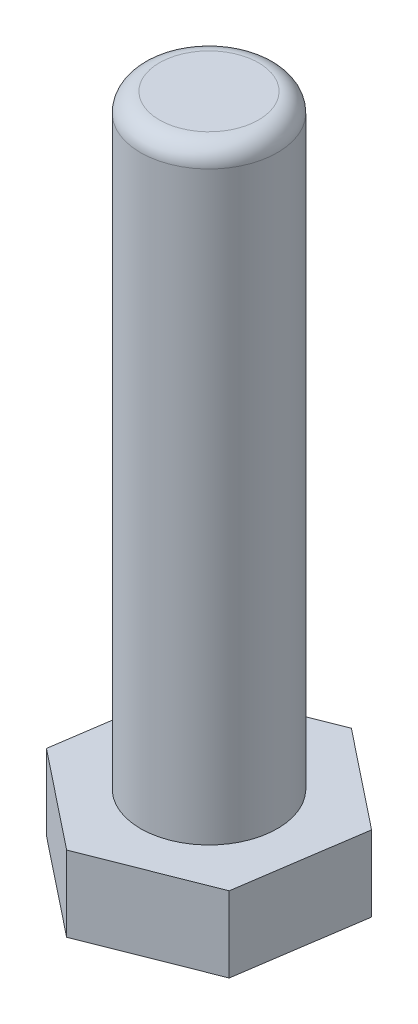
ISO-10303-21;
HEADER;
FILE_DESCRIPTION(('STEP AP214'),'2;1');
FILE_NAME('part.step','',(''),(''),'','','');
FILE_SCHEMA(('AUTOMOTIVE_DESIGN { 1 0 10303 214 1 1 1 1 }'));
ENDSEC;
DATA;
#1=APPLICATION_CONTEXT('core data for automotive mechanical design processes');
#2=APPLICATION_PROTOCOL_DEFINITION('international standard','automotive_design',2000,#1);
#3=PRODUCT_CONTEXT('',#1,'mechanical');
#4=PRODUCT('Part','Part','',(#3));
#5=PRODUCT_RELATED_PRODUCT_CATEGORY('part','',(#4));
#6=PRODUCT_DEFINITION_FORMATION('','',#4);
#7=PRODUCT_DEFINITION_CONTEXT('part definition',#1,'design');
#8=PRODUCT_DEFINITION('design','',#6,#7);
#9=PRODUCT_DEFINITION_SHAPE('','',#8);
#10=(LENGTH_UNIT() NAMED_UNIT(*) SI_UNIT(.MILLI.,.METRE.));
#11=(NAMED_UNIT(*) PLANE_ANGLE_UNIT() SI_UNIT($,.RADIAN.));
#12=(NAMED_UNIT(*) SI_UNIT($,.STERADIAN.) SOLID_ANGLE_UNIT());
#13=UNCERTAINTY_MEASURE_WITH_UNIT(LENGTH_MEASURE(1.E-05),#10,'distance_accuracy_value','');
#14=(GEOMETRIC_REPRESENTATION_CONTEXT(3) GLOBAL_UNCERTAINTY_ASSIGNED_CONTEXT((#13)) GLOBAL_UNIT_ASSIGNED_CONTEXT((#10,
#11,#12)) REPRESENTATION_CONTEXT('',''));
#15=CARTESIAN_POINT('',(0.,0.,0.));
#16=DIRECTION('',(0.,0.,1.));
#17=DIRECTION('',(1.,0.,0.));
#18=AXIS2_PLACEMENT_3D('',#15,#16,#17);
#19=CARTESIAN_POINT('',(1.95090640082265,8.,-13.1263563356787));
#20=DIRECTION('',(0.367252816111898,0.,0.93012115826804));
#21=DIRECTION('',(0.93012115826804,0.,-0.367252816111898));
#22=AXIS2_PLACEMENT_3D('',#19,#20,#21);
#23=PLANE('',#22);
#24=DIRECTION('',(-0.93012115826804,0.,0.367252816111899));
#25=VECTOR('',#24,1.);
#26=CARTESIAN_POINT('',(1.95090640082265,0.,-13.1263563356787));
#27=LINE('',#26,#25);
#28=CARTESIAN_POINT('',(1.95090640082265,0.,-13.1263563356787));
#29=VERTEX_POINT('',#28);
#30=CARTESIAN_POINT('',(-10.3923048454133,0.,-8.25271267135745));
#31=VERTEX_POINT('',#30);
#32=EDGE_CURVE('E122',#29,#31,#27,.T.);
#33=ORIENTED_EDGE('',*,*,#32,.T.);
#34=DIRECTION('',(0.,-1.,0.));
#35=VECTOR('',#34,1.);
#36=CARTESIAN_POINT('',(-10.3923048454133,8.,-8.25271267135745));
#37=LINE('',#36,#35);
#38=CARTESIAN_POINT('',(-10.3923048454133,8.,-8.25271267135745));
#39=VERTEX_POINT('',#38);
#40=EDGE_CURVE('E139',#39,#31,#37,.T.);
#41=ORIENTED_EDGE('',*,*,#40,.F.);
#42=DIRECTION('',(-0.93012115826804,0.,0.367252816111899));
#43=VECTOR('',#42,1.);
#44=CARTESIAN_POINT('',(1.95090640082265,8.,-13.1263563356787));
#45=LINE('',#44,#43);
#46=CARTESIAN_POINT('',(1.95090640082265,8.,-13.1263563356787));
#47=VERTEX_POINT('',#46);
#48=EDGE_CURVE('E132',#47,#39,#45,.T.);
#49=ORIENTED_EDGE('',*,*,#48,.F.);
#50=DIRECTION('',(0.,-1.,0.));
#51=VECTOR('',#50,1.);
#52=CARTESIAN_POINT('',(1.95090640082265,8.,-13.1263563356787));
#53=LINE('',#52,#51);
#54=EDGE_CURVE('E118',#47,#29,#53,.T.);
#55=ORIENTED_EDGE('',*,*,#54,.T.);
#56=EDGE_LOOP('',(#33,#41,#49,#55));
#57=FACE_BOUND('',#56,.T.);
#58=ADVANCED_FACE('F36',(#57),#23,.F.);
#59=CARTESIAN_POINT('',(-10.3923048454133,8.,-8.25271267135745));
#60=DIRECTION('',(0.989134959713478,0.,0.14701031076974));
#61=DIRECTION('',(0.14701031076974,0.,-0.989134959713478));
#62=AXIS2_PLACEMENT_3D('',#59,#60,#61);
#63=PLANE('',#62);
#64=DIRECTION('',(-0.14701031076974,0.,0.989134959713479));
#65=VECTOR('',#64,1.);
#66=CARTESIAN_POINT('',(-10.3923048454133,0.,-8.25271267135745));
#67=LINE('',#66,#65);
#68=CARTESIAN_POINT('',(-12.3432112462359,0.,4.87364366432128));
#69=VERTEX_POINT('',#68);
#70=EDGE_CURVE('E125',#31,#69,#67,.T.);
#71=ORIENTED_EDGE('',*,*,#70,.T.);
#72=DIRECTION('',(0.,-1.,0.));
#73=VECTOR('',#72,1.);
#74=CARTESIAN_POINT('',(-12.3432112462359,8.,4.87364366432128));
#75=LINE('',#74,#73);
#76=CARTESIAN_POINT('',(-12.3432112462359,8.,4.87364366432128));
#77=VERTEX_POINT('',#76);
#78=EDGE_CURVE('E136',#77,#69,#75,.T.);
#79=ORIENTED_EDGE('',*,*,#78,.F.);
#80=DIRECTION('',(-0.14701031076974,0.,0.989134959713479));
#81=VECTOR('',#80,1.);
#82=CARTESIAN_POINT('',(-10.3923048454133,8.,-8.25271267135745));
#83=LINE('',#82,#81);
#84=EDGE_CURVE('E91',#39,#77,#83,.T.);
#85=ORIENTED_EDGE('',*,*,#84,.F.);
#86=ORIENTED_EDGE('',*,*,#40,.T.);
#87=EDGE_LOOP('',(#71,#79,#85,#86));
#88=FACE_BOUND('',#87,.T.);
#89=ADVANCED_FACE('F152',(#88),#63,.F.);
#90=CARTESIAN_POINT('',(-12.3432112462359,8.,4.87364366432128));
#91=DIRECTION('',(0.621882143601579,0.,-0.7831108474983));
#92=DIRECTION('',(-0.7831108474983,0.,-0.621882143601579));
#93=AXIS2_PLACEMENT_3D('',#90,#91,#92);
#94=PLANE('',#93);
#95=DIRECTION('',(0.783110847498299,0.,0.621882143601579));
#96=VECTOR('',#95,1.);
#97=CARTESIAN_POINT('',(-12.3432112462359,0.,4.87364366432128));
#98=LINE('',#97,#96);
#99=CARTESIAN_POINT('',(-1.95090640082264,0.,13.1263563356787));
#100=VERTEX_POINT('',#99);
#101=EDGE_CURVE('E127',#69,#100,#98,.T.);
#102=ORIENTED_EDGE('',*,*,#101,.T.);
#103=DIRECTION('',(0.,-1.,0.));
#104=VECTOR('',#103,1.);
#105=CARTESIAN_POINT('',(-1.95090640082264,8.,13.1263563356787));
#106=LINE('',#105,#104);
#107=CARTESIAN_POINT('',(-1.95090640082264,8.,13.1263563356787));
#108=VERTEX_POINT('',#107);
#109=EDGE_CURVE('E113',#108,#100,#106,.T.);
#110=ORIENTED_EDGE('',*,*,#109,.F.);
#111=DIRECTION('',(0.783110847498299,0.,0.621882143601579));
#112=VECTOR('',#111,1.);
#113=CARTESIAN_POINT('',(-12.3432112462359,8.,4.87364366432128));
#114=LINE('',#113,#112);
#115=EDGE_CURVE('E104',#77,#108,#114,.T.);
#116=ORIENTED_EDGE('',*,*,#115,.F.);
#117=ORIENTED_EDGE('',*,*,#78,.T.);
#118=EDGE_LOOP('',(#102,#110,#116,#117));
#119=FACE_BOUND('',#118,.T.);
#120=ADVANCED_FACE('F155',(#119),#94,.F.);
#121=CARTESIAN_POINT('',(-1.95090640082264,8.,13.1263563356787));
#122=DIRECTION('',(-0.367252816111899,0.,-0.93012115826804));
#123=DIRECTION('',(-0.93012115826804,0.,0.367252816111899));
#124=AXIS2_PLACEMENT_3D('',#121,#122,#123);
#125=PLANE('',#124);
#126=DIRECTION('',(0.93012115826804,0.,-0.367252816111899));
#127=VECTOR('',#126,1.);
#128=CARTESIAN_POINT('',(-1.95090640082264,0.,13.1263563356787));
#129=LINE('',#128,#127);
#130=CARTESIAN_POINT('',(10.3923048454133,0.,8.25271267135745));
#131=VERTEX_POINT('',#130);
#132=EDGE_CURVE('E112',#100,#131,#129,.T.);
#133=ORIENTED_EDGE('',*,*,#132,.T.);
#134=DIRECTION('',(0.,-1.,0.));
#135=VECTOR('',#134,1.);
#136=CARTESIAN_POINT('',(10.3923048454133,8.,8.25271267135745));
#137=LINE('',#136,#135);
#138=CARTESIAN_POINT('',(10.3923048454133,8.,8.25271267135745));
#139=VERTEX_POINT('',#138);
#140=EDGE_CURVE('E109',#139,#131,#137,.T.);
#141=ORIENTED_EDGE('',*,*,#140,.F.);
#142=DIRECTION('',(0.93012115826804,0.,-0.367252816111899));
#143=VECTOR('',#142,1.);
#144=CARTESIAN_POINT('',(-1.95090640082264,8.,13.1263563356787));
#145=LINE('',#144,#143);
#146=EDGE_CURVE('E98',#108,#139,#145,.T.);
#147=ORIENTED_EDGE('',*,*,#146,.F.);
#148=ORIENTED_EDGE('',*,*,#109,.T.);
#149=EDGE_LOOP('',(#133,#141,#147,#148));
#150=FACE_BOUND('',#149,.T.);
#151=ADVANCED_FACE('F110',(#150),#125,.F.);
#152=CARTESIAN_POINT('',(10.3923048454133,8.,8.25271267135745));
#153=DIRECTION('',(-0.989134959713478,0.,-0.14701031076974));
#154=DIRECTION('',(-0.14701031076974,0.,0.989134959713478));
#155=AXIS2_PLACEMENT_3D('',#152,#153,#154);
#156=PLANE('',#155);
#157=DIRECTION('',(0.14701031076974,0.,-0.989134959713478));
#158=VECTOR('',#157,1.);
#159=CARTESIAN_POINT('',(10.3923048454133,0.,8.25271267135745));
#160=LINE('',#159,#158);
#161=CARTESIAN_POINT('',(12.3432112462359,0.,-4.87364366432128));
#162=VERTEX_POINT('',#161);
#163=EDGE_CURVE('E76',#131,#162,#160,.T.);
#164=ORIENTED_EDGE('',*,*,#163,.T.);
#165=DIRECTION('',(0.,-1.,0.));
#166=VECTOR('',#165,1.);
#167=CARTESIAN_POINT('',(12.3432112462359,8.,-4.87364366432128));
#168=LINE('',#167,#166);
#169=CARTESIAN_POINT('',(12.3432112462359,8.,-4.87364366432128));
#170=VERTEX_POINT('',#169);
#171=EDGE_CURVE('E114',#170,#162,#168,.T.);
#172=ORIENTED_EDGE('',*,*,#171,.F.);
#173=DIRECTION('',(0.14701031076974,0.,-0.989134959713478));
#174=VECTOR('',#173,1.);
#175=CARTESIAN_POINT('',(10.3923048454133,8.,8.25271267135745));
#176=LINE('',#175,#174);
#177=EDGE_CURVE('E102',#139,#170,#176,.T.);
#178=ORIENTED_EDGE('',*,*,#177,.F.);
#179=ORIENTED_EDGE('',*,*,#140,.T.);
#180=EDGE_LOOP('',(#164,#172,#178,#179));
#181=FACE_BOUND('',#180,.T.);
#182=ADVANCED_FACE('F116',(#181),#156,.F.);
#183=CARTESIAN_POINT('',(12.3432112462359,8.,-4.87364366432128));
#184=DIRECTION('',(-0.621882143601579,0.,0.7831108474983));
#185=DIRECTION('',(0.783110847498299,0.,0.621882143601579));
#186=AXIS2_PLACEMENT_3D('',#183,#184,#185);
#187=PLANE('',#186);
#188=DIRECTION('',(-0.7831108474983,0.,-0.621882143601579));
#189=VECTOR('',#188,1.);
#190=CARTESIAN_POINT('',(12.3432112462359,0.,-4.87364366432128));
#191=LINE('',#190,#189);
#192=EDGE_CURVE('E82',#162,#29,#191,.T.);
#193=ORIENTED_EDGE('',*,*,#192,.T.);
#194=ORIENTED_EDGE('',*,*,#54,.F.);
#195=DIRECTION('',(-0.7831108474983,0.,-0.621882143601579));
#196=VECTOR('',#195,1.);
#197=CARTESIAN_POINT('',(12.3432112462359,8.,-4.87364366432128));
#198=LINE('',#197,#196);
#199=EDGE_CURVE('E53',#170,#47,#198,.T.);
#200=ORIENTED_EDGE('',*,*,#199,.F.);
#201=ORIENTED_EDGE('',*,*,#171,.T.);
#202=EDGE_LOOP('',(#193,#194,#200,#201));
#203=FACE_BOUND('',#202,.T.);
#204=ADVANCED_FACE('F160',(#203),#187,.F.);
#205=CARTESIAN_POINT('',(0.,8.,0.));
#206=DIRECTION('',(0.,1.,0.));
#207=DIRECTION('',(0.,0.,1.));
#208=AXIS2_PLACEMENT_3D('',#205,#206,#207);
#209=PLANE('',#208);
#210=CARTESIAN_POINT('',(0.,8.,0.));
#211=DIRECTION('',(0.,1.,0.));
#212=DIRECTION('',(0.,0.,1.));
#213=AXIS2_PLACEMENT_3D('',#210,#211,#212);
#214=CIRCLE('',#213,7.25);
#215=CARTESIAN_POINT('',(0.,8.,7.25));
#216=VERTEX_POINT('',#215);
#217=EDGE_CURVE('E140',#216,#216,#214,.T.);
#218=ORIENTED_EDGE('',*,*,#217,.F.);
#219=EDGE_LOOP('',(#218));
#220=FACE_BOUND('',#219,.T.);
#221=ORIENTED_EDGE('',*,*,#48,.T.);
#222=ORIENTED_EDGE('',*,*,#84,.T.);
#223=ORIENTED_EDGE('',*,*,#115,.T.);
#224=ORIENTED_EDGE('',*,*,#146,.T.);
#225=ORIENTED_EDGE('',*,*,#177,.T.);
#226=ORIENTED_EDGE('',*,*,#199,.T.);
#227=EDGE_LOOP('',(#221,#222,#223,#224,#225,#226));
#228=FACE_BOUND('',#227,.T.);
#229=ADVANCED_FACE('F100',(#220,#228),#209,.T.);
#230=CARTESIAN_POINT('',(0.,0.,0.));
#231=DIRECTION('',(0.,1.,0.));
#232=DIRECTION('',(0.,0.,1.));
#233=AXIS2_PLACEMENT_3D('',#230,#231,#232);
#234=PLANE('',#233);
#235=ORIENTED_EDGE('',*,*,#32,.F.);
#236=ORIENTED_EDGE('',*,*,#192,.F.);
#237=ORIENTED_EDGE('',*,*,#163,.F.);
#238=ORIENTED_EDGE('',*,*,#132,.F.);
#239=ORIENTED_EDGE('',*,*,#101,.F.);
#240=ORIENTED_EDGE('',*,*,#70,.F.);
#241=EDGE_LOOP('',(#235,#236,#237,#238,#239,#240));
#242=FACE_BOUND('',#241,.T.);
#243=ADVANCED_FACE('F158',(#242),#234,.F.);
#244=CARTESIAN_POINT('',(0.,72.,0.));
#245=DIRECTION('',(0.,-1.,0.));
#246=DIRECTION('',(0.,0.,-1.));
#247=AXIS2_PLACEMENT_3D('',#244,#245,#246);
#248=CYLINDRICAL_SURFACE('',#247,7.25);
#249=CARTESIAN_POINT('',(0.,70.,0.));
#250=DIRECTION('',(0.,1.,0.));
#251=DIRECTION('',(0.,0.,1.));
#252=AXIS2_PLACEMENT_3D('',#249,#250,#251);
#253=CIRCLE('',#252,7.25);
#254=CARTESIAN_POINT('',(0.,70.,7.25));
#255=VERTEX_POINT('',#254);
#256=EDGE_CURVE('E11',#255,#255,#253,.F.);
#257=ORIENTED_EDGE('',*,*,#256,.T.);
#258=EDGE_LOOP('',(#257));
#259=FACE_BOUND('',#258,.T.);
#260=ORIENTED_EDGE('',*,*,#217,.T.);
#261=EDGE_LOOP('',(#260));
#262=FACE_BOUND('',#261,.T.);
#263=ADVANCED_FACE('F202',(#259,#262),#248,.T.);
#264=CARTESIAN_POINT('',(0.,72.,0.));
#265=DIRECTION('',(0.,1.,0.));
#266=DIRECTION('',(0.,0.,1.));
#267=AXIS2_PLACEMENT_3D('',#264,#265,#266);
#268=PLANE('',#267);
#269=CARTESIAN_POINT('',(0.,72.,0.));
#270=DIRECTION('',(0.,1.,0.));
#271=DIRECTION('',(0.,0.,1.));
#272=AXIS2_PLACEMENT_3D('',#269,#270,#271);
#273=CIRCLE('',#272,5.25);
#274=CARTESIAN_POINT('',(0.,72.,5.25));
#275=VERTEX_POINT('',#274);
#276=EDGE_CURVE('E45',#275,#275,#273,.T.);
#277=ORIENTED_EDGE('',*,*,#276,.T.);
#278=EDGE_LOOP('',(#277));
#279=FACE_BOUND('',#278,.T.);
#280=ADVANCED_FACE('F216',(#279),#268,.T.);
#281=CARTESIAN_POINT('',(0.,70.,0.));
#282=DIRECTION('',(0.,1.,0.));
#283=DIRECTION('',(0.,0.,1.));
#284=AXIS2_PLACEMENT_3D('',#281,#282,#283);
#285=TOROIDAL_SURFACE('',#284,5.25,2.);
#286=ORIENTED_EDGE('',*,*,#256,.F.);
#287=EDGE_LOOP('',(#286));
#288=FACE_BOUND('',#287,.T.);
#289=ORIENTED_EDGE('',*,*,#276,.F.);
#290=EDGE_LOOP('',(#289));
#291=FACE_BOUND('',#290,.T.);
#292=ADVANCED_FACE('F38',(#288,#291),#285,.T.);
#293=CLOSED_SHELL('',(#58,#89,#120,#151,#182,#204,#229,#243,#263,#280,#292));
#294=MANIFOLD_SOLID_BREP('B2',#293);
#295=ADVANCED_BREP_SHAPE_REPRESENTATION('',(#18,#294),#14);
#296=SHAPE_DEFINITION_REPRESENTATION(#9,#295);
ENDSEC;
END-ISO-10303-21;
